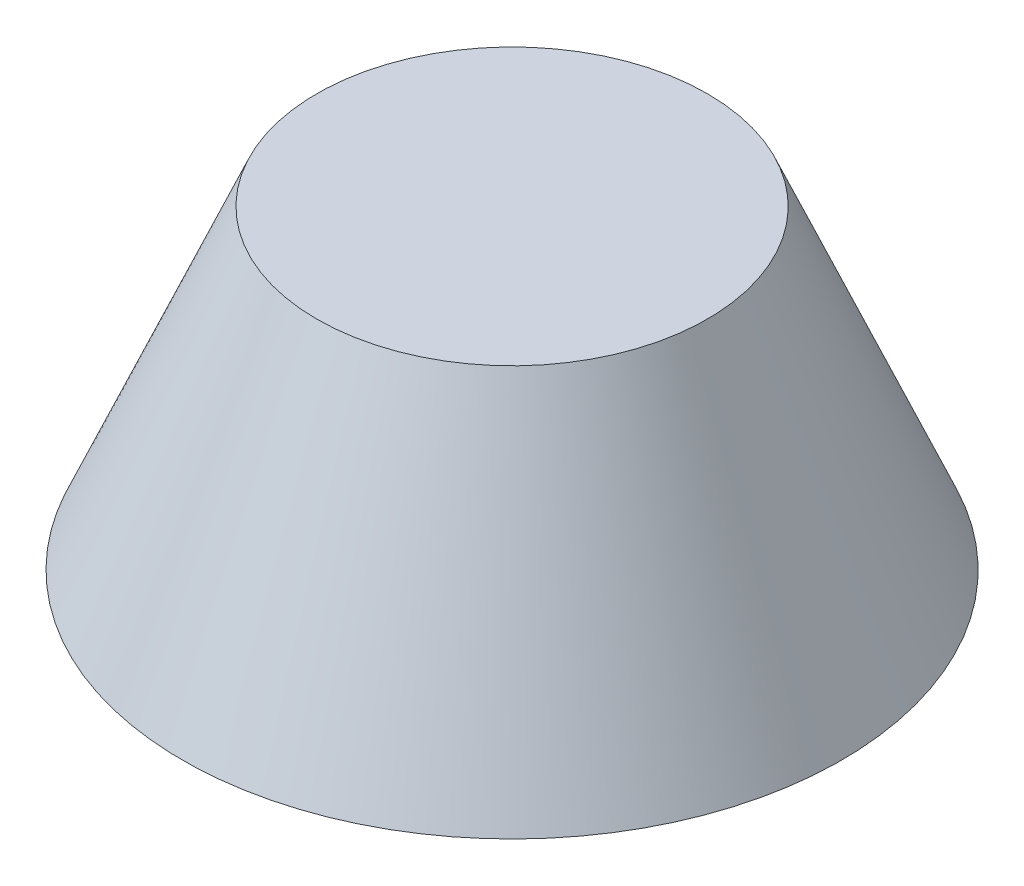
ISO-10303-21;
HEADER;
FILE_DESCRIPTION(('STEP AP214'),'2;1');
FILE_NAME('part.step','',(''),(''),'','','');
FILE_SCHEMA(('AUTOMOTIVE_DESIGN { 1 0 10303 214 1 1 1 1 }'));
ENDSEC;
DATA;
#1=APPLICATION_CONTEXT('core data for automotive mechanical design processes');
#2=APPLICATION_PROTOCOL_DEFINITION('international standard','automotive_design',2000,#1);
#3=PRODUCT_CONTEXT('',#1,'mechanical');
#4=PRODUCT('Part','Part','',(#3));
#5=PRODUCT_RELATED_PRODUCT_CATEGORY('part','',(#4));
#6=PRODUCT_DEFINITION_FORMATION('','',#4);
#7=PRODUCT_DEFINITION_CONTEXT('part definition',#1,'design');
#8=PRODUCT_DEFINITION('design','',#6,#7);
#9=PRODUCT_DEFINITION_SHAPE('','',#8);
#10=(LENGTH_UNIT() NAMED_UNIT(*) SI_UNIT(.MILLI.,.METRE.));
#11=(NAMED_UNIT(*) PLANE_ANGLE_UNIT() SI_UNIT($,.RADIAN.));
#12=(NAMED_UNIT(*) SI_UNIT($,.STERADIAN.) SOLID_ANGLE_UNIT());
#13=UNCERTAINTY_MEASURE_WITH_UNIT(LENGTH_MEASURE(1.E-05),#10,'distance_accuracy_value','');
#14=(GEOMETRIC_REPRESENTATION_CONTEXT(3) GLOBAL_UNCERTAINTY_ASSIGNED_CONTEXT((#13)) GLOBAL_UNIT_ASSIGNED_CONTEXT((#10,
#11,#12)) REPRESENTATION_CONTEXT('',''));
#15=CARTESIAN_POINT('',(0.,0.,0.));
#16=DIRECTION('',(0.,0.,1.));
#17=DIRECTION('',(1.,0.,0.));
#18=AXIS2_PLACEMENT_3D('',#15,#16,#17);
#19=CARTESIAN_POINT('',(0.,0.,0.));
#20=DIRECTION('',(0.,1.,0.));
#21=DIRECTION('',(0.,0.,1.));
#22=AXIS2_PLACEMENT_3D('',#19,#20,#21);
#23=PLANE('',#22);
#24=CARTESIAN_POINT('',(0.,0.,0.));
#25=DIRECTION('',(0.,-1.,0.));
#26=DIRECTION('',(0.,0.,-1.));
#27=AXIS2_PLACEMENT_3D('',#24,#25,#26);
#28=CIRCLE('',#27,797.687);
#29=CARTESIAN_POINT('',(0.,0.,-797.687));
#30=VERTEX_POINT('',#29);
#31=EDGE_CURVE('E10',#30,#30,#28,.T.);
#32=ORIENTED_EDGE('',*,*,#31,.T.);
#33=EDGE_LOOP('',(#32));
#34=FACE_BOUND('',#33,.T.);
#35=ADVANCED_FACE('F28',(#34),#23,.F.);
#36=CARTESIAN_POINT('',(0.,0.,0.));
#37=DIRECTION('',(0.,-1.,0.));
#38=DIRECTION('',(0.,0.,-1.));
#39=AXIS2_PLACEMENT_3D('',#36,#37,#38);
#40=CONICAL_SURFACE('',#39,797.687,0.403210980275083);
#41=CARTESIAN_POINT('',(0.,762.,0.));
#42=DIRECTION('',(0.,-1.,0.));
#43=DIRECTION('',(0.,0.,-1.));
#44=AXIS2_PLACEMENT_3D('',#41,#42,#43);
#45=CIRCLE('',#44,472.6305);
#46=CARTESIAN_POINT('',(0.,762.,-472.6305));
#47=VERTEX_POINT('',#46);
#48=EDGE_CURVE('E34',#47,#47,#45,.T.);
#49=ORIENTED_EDGE('',*,*,#48,.T.);
#50=EDGE_LOOP('',(#49));
#51=FACE_BOUND('',#50,.T.);
#52=ORIENTED_EDGE('',*,*,#31,.F.);
#53=EDGE_LOOP('',(#52));
#54=FACE_BOUND('',#53,.T.);
#55=ADVANCED_FACE('F40',(#51,#54),#40,.T.);
#56=CARTESIAN_POINT('',(0.,762.,0.));
#57=DIRECTION('',(0.,1.,0.));
#58=DIRECTION('',(0.,0.,1.));
#59=AXIS2_PLACEMENT_3D('',#56,#57,#58);
#60=PLANE('',#59);
#61=ORIENTED_EDGE('',*,*,#48,.F.);
#62=EDGE_LOOP('',(#61));
#63=FACE_BOUND('',#62,.T.);
#64=ADVANCED_FACE('F43',(#63),#60,.T.);
#65=CLOSED_SHELL('',(#35,#55,#64));
#66=MANIFOLD_SOLID_BREP('B2',#65);
#67=ADVANCED_BREP_SHAPE_REPRESENTATION('',(#18,#66),#14);
#68=SHAPE_DEFINITION_REPRESENTATION(#9,#67);
ENDSEC;
END-ISO-10303-21;
